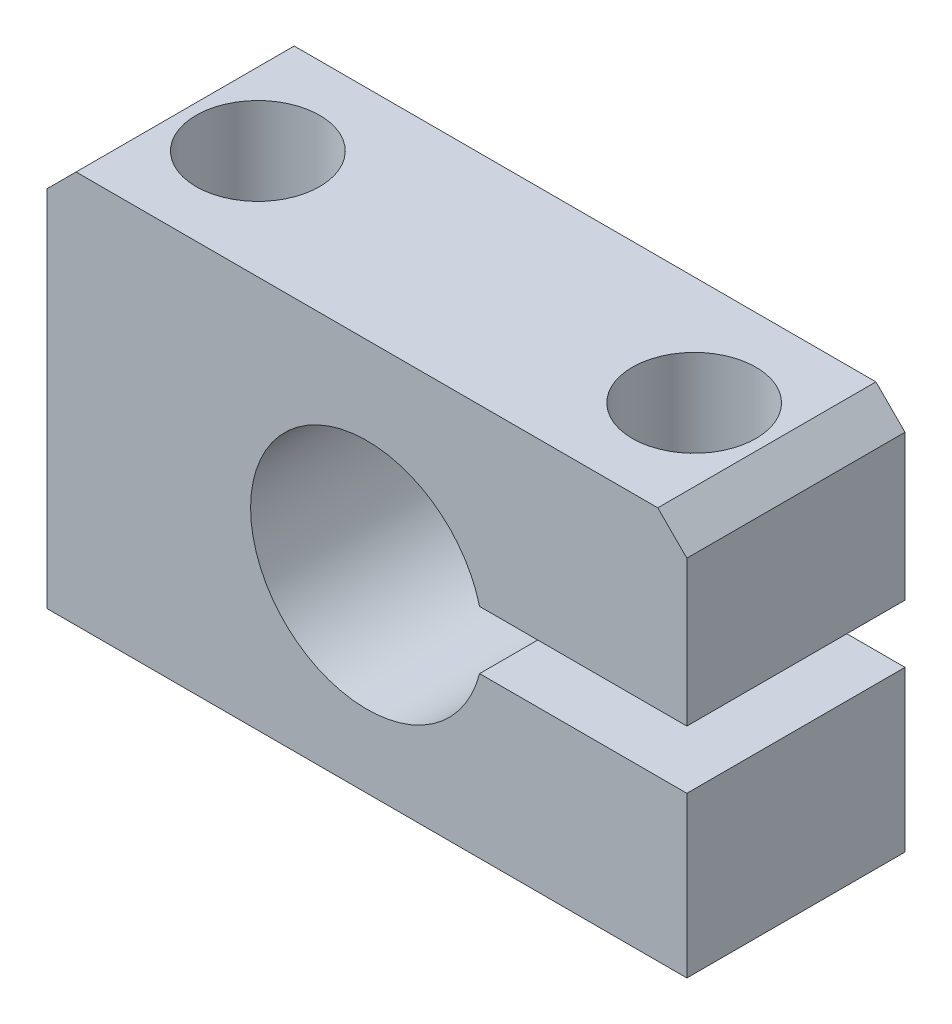
ISO-10303-21;
HEADER;
FILE_DESCRIPTION(('STEP AP214'),'2;1');
FILE_NAME('part.step','',(''),(''),'','','');
FILE_SCHEMA(('AUTOMOTIVE_DESIGN { 1 0 10303 214 1 1 1 1 }'));
ENDSEC;
DATA;
#1=APPLICATION_CONTEXT('core data for automotive mechanical design processes');
#2=APPLICATION_PROTOCOL_DEFINITION('international standard','automotive_design',2000,#1);
#3=PRODUCT_CONTEXT('',#1,'mechanical');
#4=PRODUCT('Part','Part','',(#3));
#5=PRODUCT_RELATED_PRODUCT_CATEGORY('part','',(#4));
#6=PRODUCT_DEFINITION_FORMATION('','',#4);
#7=PRODUCT_DEFINITION_CONTEXT('part definition',#1,'design');
#8=PRODUCT_DEFINITION('design','',#6,#7);
#9=PRODUCT_DEFINITION_SHAPE('','',#8);
#10=(LENGTH_UNIT() NAMED_UNIT(*) SI_UNIT(.MILLI.,.METRE.));
#11=(NAMED_UNIT(*) PLANE_ANGLE_UNIT() SI_UNIT($,.RADIAN.));
#12=(NAMED_UNIT(*) SI_UNIT($,.STERADIAN.) SOLID_ANGLE_UNIT());
#13=UNCERTAINTY_MEASURE_WITH_UNIT(LENGTH_MEASURE(1.E-05),#10,'distance_accuracy_value','');
#14=(GEOMETRIC_REPRESENTATION_CONTEXT(3) GLOBAL_UNCERTAINTY_ASSIGNED_CONTEXT((#13)) GLOBAL_UNIT_ASSIGNED_CONTEXT((#10,
#11,#12)) REPRESENTATION_CONTEXT('',''));
#15=CARTESIAN_POINT('',(0.,0.,0.));
#16=DIRECTION('',(0.,0.,1.));
#17=DIRECTION('',(1.,0.,0.));
#18=AXIS2_PLACEMENT_3D('',#15,#16,#17);
#19=CARTESIAN_POINT('',(22.,0.,15.));
#20=DIRECTION('',(-1.,0.,0.));
#21=DIRECTION('',(0.,0.,1.));
#22=AXIS2_PLACEMENT_3D('',#19,#20,#21);
#23=PLANE('',#22);
#24=DIRECTION('',(0.,1.,0.));
#25=VECTOR('',#24,1.);
#26=CARTESIAN_POINT('',(22.,0.,15.));
#27=LINE('',#26,#25);
#28=CARTESIAN_POINT('',(22.,15.,15.));
#29=VERTEX_POINT('',#28);
#30=CARTESIAN_POINT('',(22.,25.,15.));
#31=VERTEX_POINT('',#30);
#32=EDGE_CURVE('E161',#29,#31,#27,.T.);
#33=ORIENTED_EDGE('',*,*,#32,.F.);
#34=DIRECTION('',(0.,0.,1.));
#35=VECTOR('',#34,1.);
#36=CARTESIAN_POINT('',(22.,15.,-0.000999999999999265));
#37=LINE('',#36,#35);
#38=CARTESIAN_POINT('',(22.,15.,0.));
#39=VERTEX_POINT('',#38);
#40=EDGE_CURVE('E128',#39,#29,#37,.T.);
#41=ORIENTED_EDGE('',*,*,#40,.F.);
#42=DIRECTION('',(0.,1.,0.));
#43=VECTOR('',#42,1.);
#44=CARTESIAN_POINT('',(22.,0.,0.));
#45=LINE('',#44,#43);
#46=CARTESIAN_POINT('',(22.,25.,0.));
#47=VERTEX_POINT('',#46);
#48=EDGE_CURVE('E136',#39,#47,#45,.T.);
#49=ORIENTED_EDGE('',*,*,#48,.T.);
#50=DIRECTION('',(0.,0.,1.));
#51=VECTOR('',#50,1.);
#52=CARTESIAN_POINT('',(22.,25.,15.));
#53=LINE('',#52,#51);
#54=EDGE_CURVE('E11',#47,#31,#53,.T.);
#55=ORIENTED_EDGE('',*,*,#54,.T.);
#56=EDGE_LOOP('',(#33,#41,#49,#55));
#57=FACE_BOUND('',#56,.T.);
#58=ADVANCED_FACE('F41',(#57),#23,.F.);
#59=CARTESIAN_POINT('',(15.,27.,7.50000000000001));
#60=DIRECTION('',(0.,1.,0.));
#61=DIRECTION('',(0.,0.,1.));
#62=AXIS2_PLACEMENT_3D('',#59,#60,#61);
#63=CYLINDRICAL_SURFACE('',#62,2.75);
#64=CARTESIAN_POINT('',(15.,15.,7.50000000000001));
#65=DIRECTION('',(0.,1.,0.));
#66=DIRECTION('',(0.,0.,1.));
#67=AXIS2_PLACEMENT_3D('',#64,#65,#66);
#68=CIRCLE('',#67,2.75);
#69=CARTESIAN_POINT('',(15.,15.,10.25));
#70=VERTEX_POINT('',#69);
#71=EDGE_CURVE('E255',#70,#70,#68,.T.);
#72=ORIENTED_EDGE('',*,*,#71,.F.);
#73=EDGE_LOOP('',(#72));
#74=FACE_BOUND('',#73,.T.);
#75=CARTESIAN_POINT('',(15.,21.,7.50000000000001));
#76=DIRECTION('',(0.,1.,0.));
#77=DIRECTION('',(0.,0.,1.));
#78=AXIS2_PLACEMENT_3D('',#75,#76,#77);
#79=CIRCLE('',#78,2.75);
#80=CARTESIAN_POINT('',(15.,21.,10.25));
#81=VERTEX_POINT('',#80);
#82=EDGE_CURVE('E151',#81,#81,#79,.T.);
#83=ORIENTED_EDGE('',*,*,#82,.T.);
#84=EDGE_LOOP('',(#83));
#85=FACE_BOUND('',#84,.T.);
#86=ADVANCED_FACE('F284',(#74,#85),#63,.F.);
#87=CARTESIAN_POINT('',(0.,0.,15.));
#88=DIRECTION('',(0.,0.,-1.));
#89=DIRECTION('',(-1.,0.,0.));
#90=AXIS2_PLACEMENT_3D('',#87,#88,#89);
#91=PLANE('',#90);
#92=CARTESIAN_POINT('',(0.,13.,15.));
#93=DIRECTION('',(0.,0.,1.));
#94=DIRECTION('',(1.,0.,0.));
#95=AXIS2_PLACEMENT_3D('',#92,#93,#94);
#96=CIRCLE('',#95,8.);
#97=CARTESIAN_POINT('',(7.74596669241483,15.,15.));
#98=VERTEX_POINT('',#97);
#99=CARTESIAN_POINT('',(7.74596669241483,11.,15.));
#100=VERTEX_POINT('',#99);
#101=EDGE_CURVE('E143',#98,#100,#96,.T.);
#102=ORIENTED_EDGE('',*,*,#101,.F.);
#103=DIRECTION('',(-1.,0.,0.));
#104=VECTOR('',#103,1.);
#105=CARTESIAN_POINT('',(7.74596669241483,15.,15.));
#106=LINE('',#105,#104);
#107=EDGE_CURVE('E66',#29,#98,#106,.T.);
#108=ORIENTED_EDGE('',*,*,#107,.F.);
#109=ORIENTED_EDGE('',*,*,#32,.T.);
#110=DIRECTION('',(0.707106781186546,-0.707106781186549,0.));
#111=VECTOR('',#110,1.);
#112=CARTESIAN_POINT('',(20.,27.,15.));
#113=LINE('',#112,#111);
#114=CARTESIAN_POINT('',(20.,27.,15.));
#115=VERTEX_POINT('',#114);
#116=EDGE_CURVE('E207',#31,#115,#113,.F.);
#117=ORIENTED_EDGE('',*,*,#116,.T.);
#118=DIRECTION('',(-1.,0.,0.));
#119=VECTOR('',#118,1.);
#120=CARTESIAN_POINT('',(-22.,27.,15.));
#121=LINE('',#120,#119);
#122=CARTESIAN_POINT('',(-20.,27.,15.));
#123=VERTEX_POINT('',#122);
#124=EDGE_CURVE('E166',#115,#123,#121,.T.);
#125=ORIENTED_EDGE('',*,*,#124,.T.);
#126=DIRECTION('',(0.707106781186549,0.707106781186546,0.));
#127=VECTOR('',#126,1.);
#128=CARTESIAN_POINT('',(-22.,25.,15.));
#129=LINE('',#128,#127);
#130=CARTESIAN_POINT('',(-22.,25.,15.));
#131=VERTEX_POINT('',#130);
#132=EDGE_CURVE('E51',#123,#131,#129,.F.);
#133=ORIENTED_EDGE('',*,*,#132,.T.);
#134=DIRECTION('',(0.,-1.,0.));
#135=VECTOR('',#134,1.);
#136=CARTESIAN_POINT('',(-22.,0.,15.));
#137=LINE('',#136,#135);
#138=CARTESIAN_POINT('',(-22.,0.,15.));
#139=VERTEX_POINT('',#138);
#140=EDGE_CURVE('E154',#131,#139,#137,.T.);
#141=ORIENTED_EDGE('',*,*,#140,.T.);
#142=DIRECTION('',(1.,0.,0.));
#143=VECTOR('',#142,1.);
#144=CARTESIAN_POINT('',(22.,0.,15.));
#145=LINE('',#144,#143);
#146=CARTESIAN_POINT('',(22.,0.,15.));
#147=VERTEX_POINT('',#146);
#148=EDGE_CURVE('E157',#139,#147,#145,.T.);
#149=ORIENTED_EDGE('',*,*,#148,.T.);
#150=CARTESIAN_POINT('',(22.,11.,15.));
#151=VERTEX_POINT('',#150);
#152=EDGE_CURVE('E162',#147,#151,#27,.T.);
#153=ORIENTED_EDGE('',*,*,#152,.T.);
#154=DIRECTION('',(1.,0.,0.));
#155=VECTOR('',#154,1.);
#156=CARTESIAN_POINT('',(7.74596669241483,11.,15.));
#157=LINE('',#156,#155);
#158=EDGE_CURVE('E138',#100,#151,#157,.T.);
#159=ORIENTED_EDGE('',*,*,#158,.F.);
#160=EDGE_LOOP('',(#102,#108,#109,#117,#125,#133,#141,#149,#153,#159));
#161=FACE_BOUND('',#160,.T.);
#162=ADVANCED_FACE('F213',(#161),#91,.F.);
#163=CARTESIAN_POINT('',(0.,0.,0.));
#164=DIRECTION('',(0.,0.,-1.));
#165=DIRECTION('',(-1.,0.,0.));
#166=AXIS2_PLACEMENT_3D('',#163,#164,#165);
#167=PLANE('',#166);
#168=DIRECTION('',(-1.,0.,0.));
#169=VECTOR('',#168,1.);
#170=CARTESIAN_POINT('',(7.74596669241483,15.,0.));
#171=LINE('',#170,#169);
#172=CARTESIAN_POINT('',(7.74596669241483,15.,0.));
#173=VERTEX_POINT('',#172);
#174=EDGE_CURVE('E120',#39,#173,#171,.T.);
#175=ORIENTED_EDGE('',*,*,#174,.T.);
#176=CARTESIAN_POINT('',(0.,13.,0.));
#177=DIRECTION('',(0.,0.,1.));
#178=DIRECTION('',(1.,0.,0.));
#179=AXIS2_PLACEMENT_3D('',#176,#177,#178);
#180=CIRCLE('',#179,8.);
#181=CARTESIAN_POINT('',(7.74596669241483,11.,0.));
#182=VERTEX_POINT('',#181);
#183=EDGE_CURVE('E134',#173,#182,#180,.T.);
#184=ORIENTED_EDGE('',*,*,#183,.T.);
#185=DIRECTION('',(1.,0.,0.));
#186=VECTOR('',#185,1.);
#187=CARTESIAN_POINT('',(7.74596669241483,11.,0.));
#188=LINE('',#187,#186);
#189=CARTESIAN_POINT('',(22.,11.,0.));
#190=VERTEX_POINT('',#189);
#191=EDGE_CURVE('E58',#182,#190,#188,.T.);
#192=ORIENTED_EDGE('',*,*,#191,.T.);
#193=CARTESIAN_POINT('',(22.,0.,0.));
#194=VERTEX_POINT('',#193);
#195=EDGE_CURVE('E176',#194,#190,#45,.T.);
#196=ORIENTED_EDGE('',*,*,#195,.F.);
#197=DIRECTION('',(1.,0.,0.));
#198=VECTOR('',#197,1.);
#199=CARTESIAN_POINT('',(22.,0.,0.));
#200=LINE('',#199,#198);
#201=CARTESIAN_POINT('',(-22.,0.,0.));
#202=VERTEX_POINT('',#201);
#203=EDGE_CURVE('E173',#202,#194,#200,.T.);
#204=ORIENTED_EDGE('',*,*,#203,.F.);
#205=DIRECTION('',(0.,-1.,0.));
#206=VECTOR('',#205,1.);
#207=CARTESIAN_POINT('',(-22.,0.,0.));
#208=LINE('',#207,#206);
#209=CARTESIAN_POINT('',(-22.,25.,0.));
#210=VERTEX_POINT('',#209);
#211=EDGE_CURVE('E148',#210,#202,#208,.T.);
#212=ORIENTED_EDGE('',*,*,#211,.F.);
#213=DIRECTION('',(-0.707106781186549,-0.707106781186546,0.));
#214=VECTOR('',#213,1.);
#215=CARTESIAN_POINT('',(-23.5,23.5,0.));
#216=LINE('',#215,#214);
#217=CARTESIAN_POINT('',(-20.,27.,0.));
#218=VERTEX_POINT('',#217);
#219=EDGE_CURVE('E197',#210,#218,#216,.F.);
#220=ORIENTED_EDGE('',*,*,#219,.T.);
#221=DIRECTION('',(-1.,0.,0.));
#222=VECTOR('',#221,1.);
#223=CARTESIAN_POINT('',(-22.,27.,0.));
#224=LINE('',#223,#222);
#225=CARTESIAN_POINT('',(20.,27.,0.));
#226=VERTEX_POINT('',#225);
#227=EDGE_CURVE('E158',#226,#218,#224,.T.);
#228=ORIENTED_EDGE('',*,*,#227,.F.);
#229=DIRECTION('',(-0.707106781186546,0.707106781186549,0.));
#230=VECTOR('',#229,1.);
#231=CARTESIAN_POINT('',(23.5,23.4999999999999,0.));
#232=LINE('',#231,#230);
#233=EDGE_CURVE('E194',#226,#47,#232,.F.);
#234=ORIENTED_EDGE('',*,*,#233,.T.);
#235=ORIENTED_EDGE('',*,*,#48,.F.);
#236=EDGE_LOOP('',(#175,#184,#192,#196,#204,#212,#220,#228,#234,#235));
#237=FACE_BOUND('',#236,.T.);
#238=ADVANCED_FACE('F133',(#237),#167,.T.);
#239=CARTESIAN_POINT('',(-22.,0.,15.));
#240=DIRECTION('',(1.,0.,0.));
#241=DIRECTION('',(0.,0.,-1.));
#242=AXIS2_PLACEMENT_3D('',#239,#240,#241);
#243=PLANE('',#242);
#244=ORIENTED_EDGE('',*,*,#140,.F.);
#245=DIRECTION('',(0.,0.,-1.));
#246=VECTOR('',#245,1.);
#247=CARTESIAN_POINT('',(-22.,25.,15.));
#248=LINE('',#247,#246);
#249=EDGE_CURVE('E190',#131,#210,#248,.T.);
#250=ORIENTED_EDGE('',*,*,#249,.T.);
#251=ORIENTED_EDGE('',*,*,#211,.T.);
#252=DIRECTION('',(0.,0.,-1.));
#253=VECTOR('',#252,1.);
#254=CARTESIAN_POINT('',(-22.,0.,15.));
#255=LINE('',#254,#253);
#256=EDGE_CURVE('E186',#139,#202,#255,.T.);
#257=ORIENTED_EDGE('',*,*,#256,.F.);
#258=EDGE_LOOP('',(#244,#250,#251,#257));
#259=FACE_BOUND('',#258,.T.);
#260=ADVANCED_FACE('F221',(#259),#243,.F.);
#261=CARTESIAN_POINT('',(22.,0.,15.));
#262=DIRECTION('',(0.,1.,0.));
#263=DIRECTION('',(-1.,0.,0.));
#264=AXIS2_PLACEMENT_3D('',#261,#262,#263);
#265=PLANE('',#264);
#266=CARTESIAN_POINT('',(-15.,0.,7.5));
#267=DIRECTION('',(0.,1.,0.));
#268=DIRECTION('',(-1.,0.,0.));
#269=AXIS2_PLACEMENT_3D('',#266,#267,#268);
#270=CIRCLE('',#269,2.75);
#271=CARTESIAN_POINT('',(-17.75,0.,7.5));
#272=VERTEX_POINT('',#271);
#273=EDGE_CURVE('E268',#272,#272,#270,.T.);
#274=ORIENTED_EDGE('',*,*,#273,.T.);
#275=EDGE_LOOP('',(#274));
#276=FACE_BOUND('',#275,.T.);
#277=CARTESIAN_POINT('',(15.,0.,7.50000000000001));
#278=DIRECTION('',(0.,1.,0.));
#279=DIRECTION('',(-1.,0.,0.));
#280=AXIS2_PLACEMENT_3D('',#277,#278,#279);
#281=CIRCLE('',#280,2.75);
#282=CARTESIAN_POINT('',(12.25,0.,7.50000000000001));
#283=VERTEX_POINT('',#282);
#284=EDGE_CURVE('E144',#283,#283,#281,.T.);
#285=ORIENTED_EDGE('',*,*,#284,.T.);
#286=EDGE_LOOP('',(#285));
#287=FACE_BOUND('',#286,.T.);
#288=ORIENTED_EDGE('',*,*,#203,.T.);
#289=DIRECTION('',(0.,0.,-1.));
#290=VECTOR('',#289,1.);
#291=CARTESIAN_POINT('',(22.,0.,15.));
#292=LINE('',#291,#290);
#293=EDGE_CURVE('E170',#147,#194,#292,.T.);
#294=ORIENTED_EDGE('',*,*,#293,.F.);
#295=ORIENTED_EDGE('',*,*,#148,.F.);
#296=ORIENTED_EDGE('',*,*,#256,.T.);
#297=EDGE_LOOP('',(#288,#294,#295,#296));
#298=FACE_BOUND('',#297,.T.);
#299=ADVANCED_FACE('F309',(#276,#287,#298),#265,.F.);
#300=ORIENTED_EDGE('',*,*,#195,.T.);
#301=DIRECTION('',(0.,0.,1.));
#302=VECTOR('',#301,1.);
#303=CARTESIAN_POINT('',(22.,11.,-0.000999999999999265));
#304=LINE('',#303,#302);
#305=EDGE_CURVE('E241',#190,#151,#304,.T.);
#306=ORIENTED_EDGE('',*,*,#305,.T.);
#307=ORIENTED_EDGE('',*,*,#152,.F.);
#308=ORIENTED_EDGE('',*,*,#293,.T.);
#309=EDGE_LOOP('',(#300,#306,#307,#308));
#310=FACE_BOUND('',#309,.T.);
#311=ADVANCED_FACE('F301',(#310),#23,.F.);
#312=CARTESIAN_POINT('',(-22.,27.,15.));
#313=DIRECTION('',(0.,-1.,0.));
#314=DIRECTION('',(1.,0.,0.));
#315=AXIS2_PLACEMENT_3D('',#312,#313,#314);
#316=PLANE('',#315);
#317=CARTESIAN_POINT('',(-15.,27.,7.5));
#318=DIRECTION('',(0.,1.,0.));
#319=DIRECTION('',(0.,0.,1.));
#320=AXIS2_PLACEMENT_3D('',#317,#318,#319);
#321=CIRCLE('',#320,4.24999999999999);
#322=CARTESIAN_POINT('',(-15.,27.,11.75));
#323=VERTEX_POINT('',#322);
#324=EDGE_CURVE('E256',#323,#323,#321,.T.);
#325=ORIENTED_EDGE('',*,*,#324,.F.);
#326=EDGE_LOOP('',(#325));
#327=FACE_BOUND('',#326,.T.);
#328=CARTESIAN_POINT('',(15.,27.,7.50000000000001));
#329=DIRECTION('',(0.,1.,0.));
#330=DIRECTION('',(0.,0.,1.));
#331=AXIS2_PLACEMENT_3D('',#328,#329,#330);
#332=CIRCLE('',#331,4.24999999999999);
#333=CARTESIAN_POINT('',(15.,27.,11.75));
#334=VERTEX_POINT('',#333);
#335=EDGE_CURVE('E272',#334,#334,#332,.T.);
#336=ORIENTED_EDGE('',*,*,#335,.F.);
#337=EDGE_LOOP('',(#336));
#338=FACE_BOUND('',#337,.T.);
#339=ORIENTED_EDGE('',*,*,#227,.T.);
#340=DIRECTION('',(0.,0.,1.));
#341=VECTOR('',#340,1.);
#342=CARTESIAN_POINT('',(-20.,27.,15.));
#343=LINE('',#342,#341);
#344=EDGE_CURVE('E204',#218,#123,#343,.T.);
#345=ORIENTED_EDGE('',*,*,#344,.T.);
#346=ORIENTED_EDGE('',*,*,#124,.F.);
#347=DIRECTION('',(0.,0.,-1.));
#348=VECTOR('',#347,1.);
#349=CARTESIAN_POINT('',(20.,27.,15.));
#350=LINE('',#349,#348);
#351=EDGE_CURVE('E200',#115,#226,#350,.T.);
#352=ORIENTED_EDGE('',*,*,#351,.T.);
#353=EDGE_LOOP('',(#339,#345,#346,#352));
#354=FACE_BOUND('',#353,.T.);
#355=ADVANCED_FACE('F227',(#327,#338,#354),#316,.F.);
#356=CARTESIAN_POINT('',(0.,13.,15.));
#357=DIRECTION('',(0.,0.,-1.));
#358=DIRECTION('',(-1.,0.,0.));
#359=AXIS2_PLACEMENT_3D('',#356,#357,#358);
#360=CYLINDRICAL_SURFACE('',#359,8.);
#361=DIRECTION('',(0.,0.,1.));
#362=VECTOR('',#361,1.);
#363=CARTESIAN_POINT('',(7.74596669241483,15.,-0.000999999999999265));
#364=LINE('',#363,#362);
#365=EDGE_CURVE('E117',#173,#98,#364,.T.);
#366=ORIENTED_EDGE('',*,*,#365,.T.);
#367=ORIENTED_EDGE('',*,*,#101,.T.);
#368=DIRECTION('',(0.,0.,1.));
#369=VECTOR('',#368,1.);
#370=CARTESIAN_POINT('',(7.74596669241483,11.,-0.000999999999999265));
#371=LINE('',#370,#369);
#372=EDGE_CURVE('E141',#182,#100,#371,.T.);
#373=ORIENTED_EDGE('',*,*,#372,.F.);
#374=ORIENTED_EDGE('',*,*,#183,.F.);
#375=EDGE_LOOP('',(#366,#367,#373,#374));
#376=FACE_BOUND('',#375,.T.);
#377=ADVANCED_FACE('F140',(#376),#360,.F.);
#378=CARTESIAN_POINT('',(15.,11.,7.50000000000001));
#379=DIRECTION('',(0.,-1.,0.));
#380=DIRECTION('',(0.,0.,-1.));
#381=AXIS2_PLACEMENT_3D('',#378,#379,#380);
#382=CIRCLE('',#381,2.75);
#383=CARTESIAN_POINT('',(15.,11.,4.75000000000002));
#384=VERTEX_POINT('',#383);
#385=EDGE_CURVE('E127',#384,#384,#382,.T.);
#386=ORIENTED_EDGE('',*,*,#385,.F.);
#387=EDGE_LOOP('',(#386));
#388=FACE_BOUND('',#387,.T.);
#389=ORIENTED_EDGE('',*,*,#284,.F.);
#390=EDGE_LOOP('',(#389));
#391=FACE_BOUND('',#390,.T.);
#392=ADVANCED_FACE('F290',(#388,#391),#63,.F.);
#393=CARTESIAN_POINT('',(17.75,21.,7.50000000000001));
#394=DIRECTION('',(0.,-1.,0.));
#395=DIRECTION('',(0.,0.,-1.));
#396=AXIS2_PLACEMENT_3D('',#393,#394,#395);
#397=PLANE('',#396);
#398=ORIENTED_EDGE('',*,*,#82,.F.);
#399=EDGE_LOOP('',(#398));
#400=FACE_BOUND('',#399,.T.);
#401=CARTESIAN_POINT('',(15.,21.,7.50000000000001));
#402=DIRECTION('',(0.,1.,0.));
#403=DIRECTION('',(0.,0.,1.));
#404=AXIS2_PLACEMENT_3D('',#401,#402,#403);
#405=CIRCLE('',#404,4.25);
#406=CARTESIAN_POINT('',(15.,21.,11.75));
#407=VERTEX_POINT('',#406);
#408=EDGE_CURVE('E276',#407,#407,#405,.T.);
#409=ORIENTED_EDGE('',*,*,#408,.T.);
#410=EDGE_LOOP('',(#409));
#411=FACE_BOUND('',#410,.T.);
#412=ADVANCED_FACE('F286',(#400,#411),#397,.F.);
#413=CARTESIAN_POINT('',(15.,27.,7.50000000000001));
#414=DIRECTION('',(0.,1.,0.));
#415=DIRECTION('',(0.,0.,1.));
#416=AXIS2_PLACEMENT_3D('',#413,#414,#415);
#417=CYLINDRICAL_SURFACE('',#416,4.24999999999999);
#418=ORIENTED_EDGE('',*,*,#408,.F.);
#419=EDGE_LOOP('',(#418));
#420=FACE_BOUND('',#419,.T.);
#421=ORIENTED_EDGE('',*,*,#335,.T.);
#422=EDGE_LOOP('',(#421));
#423=FACE_BOUND('',#422,.T.);
#424=ADVANCED_FACE('F289',(#420,#423),#417,.F.);
#425=CARTESIAN_POINT('',(-15.,27.,7.5));
#426=DIRECTION('',(0.,1.,0.));
#427=DIRECTION('',(0.,0.,1.));
#428=AXIS2_PLACEMENT_3D('',#425,#426,#427);
#429=CYLINDRICAL_SURFACE('',#428,2.75);
#430=ORIENTED_EDGE('',*,*,#273,.F.);
#431=EDGE_LOOP('',(#430));
#432=FACE_BOUND('',#431,.T.);
#433=CARTESIAN_POINT('',(-15.,21.,7.5));
#434=DIRECTION('',(0.,1.,0.));
#435=DIRECTION('',(0.,0.,1.));
#436=AXIS2_PLACEMENT_3D('',#433,#434,#435);
#437=CIRCLE('',#436,2.75);
#438=CARTESIAN_POINT('',(-15.,21.,10.25));
#439=VERTEX_POINT('',#438);
#440=EDGE_CURVE('E264',#439,#439,#437,.T.);
#441=ORIENTED_EDGE('',*,*,#440,.T.);
#442=EDGE_LOOP('',(#441));
#443=FACE_BOUND('',#442,.T.);
#444=ADVANCED_FACE('F296',(#432,#443),#429,.F.);
#445=CARTESIAN_POINT('',(-12.25,21.,7.5));
#446=DIRECTION('',(0.,-1.,0.));
#447=DIRECTION('',(0.,0.,-1.));
#448=AXIS2_PLACEMENT_3D('',#445,#446,#447);
#449=PLANE('',#448);
#450=ORIENTED_EDGE('',*,*,#440,.F.);
#451=EDGE_LOOP('',(#450));
#452=FACE_BOUND('',#451,.T.);
#453=CARTESIAN_POINT('',(-15.,21.,7.5));
#454=DIRECTION('',(0.,1.,0.));
#455=DIRECTION('',(0.,0.,1.));
#456=AXIS2_PLACEMENT_3D('',#453,#454,#455);
#457=CIRCLE('',#456,4.25);
#458=CARTESIAN_POINT('',(-15.,21.,11.75));
#459=VERTEX_POINT('',#458);
#460=EDGE_CURVE('E260',#459,#459,#457,.T.);
#461=ORIENTED_EDGE('',*,*,#460,.T.);
#462=EDGE_LOOP('',(#461));
#463=FACE_BOUND('',#462,.T.);
#464=ADVANCED_FACE('F335',(#452,#463),#449,.F.);
#465=CARTESIAN_POINT('',(-15.,27.,7.5));
#466=DIRECTION('',(0.,1.,0.));
#467=DIRECTION('',(0.,0.,1.));
#468=AXIS2_PLACEMENT_3D('',#465,#466,#467);
#469=CYLINDRICAL_SURFACE('',#468,4.24999999999999);
#470=ORIENTED_EDGE('',*,*,#460,.F.);
#471=EDGE_LOOP('',(#470));
#472=FACE_BOUND('',#471,.T.);
#473=ORIENTED_EDGE('',*,*,#324,.T.);
#474=EDGE_LOOP('',(#473));
#475=FACE_BOUND('',#474,.T.);
#476=ADVANCED_FACE('F329',(#472,#475),#469,.F.);
#477=CARTESIAN_POINT('',(-22.,25.,15.));
#478=DIRECTION('',(0.707106781186546,-0.707106781186549,0.));
#479=DIRECTION('',(0.,0.,-1.));
#480=AXIS2_PLACEMENT_3D('',#477,#478,#479);
#481=PLANE('',#480);
#482=ORIENTED_EDGE('',*,*,#132,.F.);
#483=ORIENTED_EDGE('',*,*,#344,.F.);
#484=ORIENTED_EDGE('',*,*,#219,.F.);
#485=ORIENTED_EDGE('',*,*,#249,.F.);
#486=EDGE_LOOP('',(#482,#483,#484,#485));
#487=FACE_BOUND('',#486,.T.);
#488=ADVANCED_FACE('F223',(#487),#481,.F.);
#489=CARTESIAN_POINT('',(20.,27.,15.));
#490=DIRECTION('',(-0.707106781186549,-0.707106781186546,0.));
#491=DIRECTION('',(0.,0.,-1.));
#492=AXIS2_PLACEMENT_3D('',#489,#490,#491);
#493=PLANE('',#492);
#494=ORIENTED_EDGE('',*,*,#116,.F.);
#495=ORIENTED_EDGE('',*,*,#54,.F.);
#496=ORIENTED_EDGE('',*,*,#233,.F.);
#497=ORIENTED_EDGE('',*,*,#351,.F.);
#498=EDGE_LOOP('',(#494,#495,#496,#497));
#499=FACE_BOUND('',#498,.T.);
#500=ADVANCED_FACE('F44',(#499),#493,.F.);
#501=CARTESIAN_POINT('',(7.74596669241483,11.,-0.000999999999999265));
#502=DIRECTION('',(0.,-1.,0.));
#503=DIRECTION('',(0.,0.,-1.));
#504=AXIS2_PLACEMENT_3D('',#501,#502,#503);
#505=PLANE('',#504);
#506=ORIENTED_EDGE('',*,*,#385,.T.);
#507=EDGE_LOOP('',(#506));
#508=FACE_BOUND('',#507,.T.);
#509=ORIENTED_EDGE('',*,*,#372,.T.);
#510=ORIENTED_EDGE('',*,*,#158,.T.);
#511=ORIENTED_EDGE('',*,*,#305,.F.);
#512=ORIENTED_EDGE('',*,*,#191,.F.);
#513=EDGE_LOOP('',(#509,#510,#511,#512));
#514=FACE_BOUND('',#513,.T.);
#515=ADVANCED_FACE('F334',(#508,#514),#505,.F.);
#516=CARTESIAN_POINT('',(7.74596669241483,15.,-0.000999999999999265));
#517=DIRECTION('',(0.,1.,0.));
#518=DIRECTION('',(0.,0.,1.));
#519=AXIS2_PLACEMENT_3D('',#516,#517,#518);
#520=PLANE('',#519);
#521=ORIENTED_EDGE('',*,*,#71,.T.);
#522=EDGE_LOOP('',(#521));
#523=FACE_BOUND('',#522,.T.);
#524=ORIENTED_EDGE('',*,*,#40,.T.);
#525=ORIENTED_EDGE('',*,*,#107,.T.);
#526=ORIENTED_EDGE('',*,*,#365,.F.);
#527=ORIENTED_EDGE('',*,*,#174,.F.);
#528=EDGE_LOOP('',(#524,#525,#526,#527));
#529=FACE_BOUND('',#528,.T.);
#530=ADVANCED_FACE('F119',(#523,#529),#520,.F.);
#531=CLOSED_SHELL('',(#58,#86,#162,#238,#260,#299,#311,#355,#377,#392,#412,#424,#444,#464,#476,
#488,#500,#515,#530));
#532=MANIFOLD_SOLID_BREP('B2',#531);
#533=ADVANCED_BREP_SHAPE_REPRESENTATION('',(#18,#532),#14);
#534=SHAPE_DEFINITION_REPRESENTATION(#9,#533);
ENDSEC;
END-ISO-10303-21;
